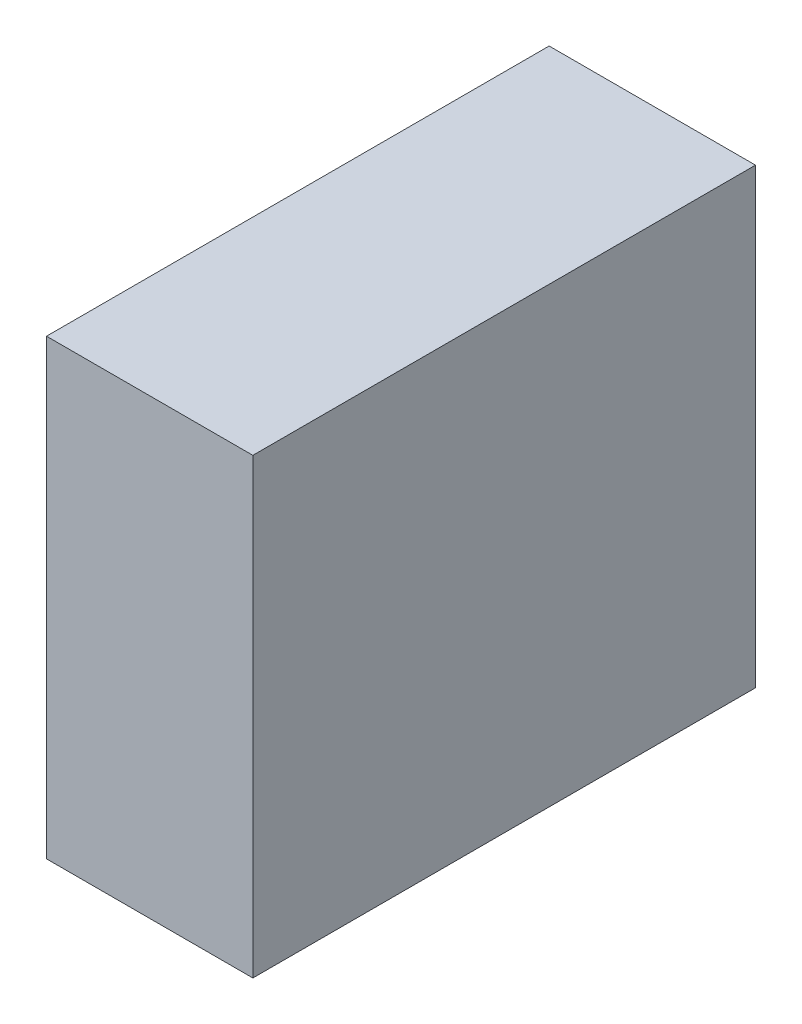
ISO-10303-21;
HEADER;
FILE_DESCRIPTION(('STEP AP214'),'2;1');
FILE_NAME('part.step','',(''),(''),'','','');
FILE_SCHEMA(('AUTOMOTIVE_DESIGN { 1 0 10303 214 1 1 1 1 }'));
ENDSEC;
DATA;
#1=APPLICATION_CONTEXT('core data for automotive mechanical design processes');
#2=APPLICATION_PROTOCOL_DEFINITION('international standard','automotive_design',2000,#1);
#3=PRODUCT_CONTEXT('',#1,'mechanical');
#4=PRODUCT('Part','Part','',(#3));
#5=PRODUCT_RELATED_PRODUCT_CATEGORY('part','',(#4));
#6=PRODUCT_DEFINITION_FORMATION('','',#4);
#7=PRODUCT_DEFINITION_CONTEXT('part definition',#1,'design');
#8=PRODUCT_DEFINITION('design','',#6,#7);
#9=PRODUCT_DEFINITION_SHAPE('','',#8);
#10=(LENGTH_UNIT() NAMED_UNIT(*) SI_UNIT(.MILLI.,.METRE.));
#11=(NAMED_UNIT(*) PLANE_ANGLE_UNIT() SI_UNIT($,.RADIAN.));
#12=(NAMED_UNIT(*) SI_UNIT($,.STERADIAN.) SOLID_ANGLE_UNIT());
#13=UNCERTAINTY_MEASURE_WITH_UNIT(LENGTH_MEASURE(1.E-05),#10,'distance_accuracy_value','');
#14=(GEOMETRIC_REPRESENTATION_CONTEXT(3) GLOBAL_UNCERTAINTY_ASSIGNED_CONTEXT((#13)) GLOBAL_UNIT_ASSIGNED_CONTEXT((#10,
#11,#12)) REPRESENTATION_CONTEXT('',''));
#15=CARTESIAN_POINT('',(0.,0.,0.));
#16=DIRECTION('',(0.,0.,1.));
#17=DIRECTION('',(1.,0.,0.));
#18=AXIS2_PLACEMENT_3D('',#15,#16,#17);
#19=CARTESIAN_POINT('',(38.2695703209719,1.49999995944139,23.435));
#20=DIRECTION('',(0.,-1.,0.));
#21=DIRECTION('',(0.,0.,-1.));
#22=AXIS2_PLACEMENT_3D('',#19,#20,#21);
#23=PLANE('',#22);
#24=DIRECTION('',(1.,0.,0.));
#25=VECTOR('',#24,1.);
#26=CARTESIAN_POINT('',(42.6021416337541,1.49999995944139,18.57));
#27=LINE('',#26,#25);
#28=CARTESIAN_POINT('',(34.0221416337541,1.49999995944138,18.57));
#29=VERTEX_POINT('',#28);
#30=CARTESIAN_POINT('',(42.6021416337541,1.49999995944139,18.57));
#31=VERTEX_POINT('',#30);
#32=EDGE_CURVE('E26',#29,#31,#27,.T.);
#33=ORIENTED_EDGE('',*,*,#32,.T.);
#34=DIRECTION('',(0.,0.,1.));
#35=VECTOR('',#34,1.);
#36=CARTESIAN_POINT('',(42.6021416337541,1.49999995944139,39.47));
#37=LINE('',#36,#35);
#38=CARTESIAN_POINT('',(42.6021416337541,1.49999995944139,39.47));
#39=VERTEX_POINT('',#38);
#40=EDGE_CURVE('E11',#31,#39,#37,.T.);
#41=ORIENTED_EDGE('',*,*,#40,.T.);
#42=DIRECTION('',(-1.,0.,0.));
#43=VECTOR('',#42,1.);
#44=CARTESIAN_POINT('',(21.301070816877,1.5,39.47));
#45=LINE('',#44,#43);
#46=CARTESIAN_POINT('',(34.0221416337541,1.49999995944139,39.47));
#47=VERTEX_POINT('',#46);
#48=EDGE_CURVE('E20',#39,#47,#45,.T.);
#49=ORIENTED_EDGE('',*,*,#48,.T.);
#50=DIRECTION('',(0.,0.,-1.));
#51=VECTOR('',#50,1.);
#52=CARTESIAN_POINT('',(34.0221416337541,1.5,19.735));
#53=LINE('',#52,#51);
#54=EDGE_CURVE('E60',#47,#29,#53,.T.);
#55=ORIENTED_EDGE('',*,*,#54,.T.);
#56=EDGE_LOOP('',(#33,#41,#49,#55));
#57=FACE_BOUND('',#56,.T.);
#58=ADVANCED_FACE('F16',(#57),#23,.T.);
#59=CARTESIAN_POINT('',(42.6021416337541,20.3220000107563,18.57));
#60=DIRECTION('',(1.,0.,0.));
#61=DIRECTION('',(0.,1.,0.));
#62=AXIS2_PLACEMENT_3D('',#59,#60,#61);
#63=PLANE('',#62);
#64=DIRECTION('',(0.,0.,-1.));
#65=VECTOR('',#64,1.);
#66=CARTESIAN_POINT('',(42.6021416337541,20.3220000107563,39.47));
#67=LINE('',#66,#65);
#68=CARTESIAN_POINT('',(42.6021416337541,20.3220000107563,39.47));
#69=VERTEX_POINT('',#68);
#70=CARTESIAN_POINT('',(42.6021416337541,20.3220000107563,18.57));
#71=VERTEX_POINT('',#70);
#72=EDGE_CURVE('E100',#69,#71,#67,.T.);
#73=ORIENTED_EDGE('',*,*,#72,.F.);
#74=DIRECTION('',(0.,-1.,0.));
#75=VECTOR('',#74,1.);
#76=CARTESIAN_POINT('',(42.6021416337541,20.3220000107563,39.47));
#77=LINE('',#76,#75);
#78=EDGE_CURVE('E79',#69,#39,#77,.T.);
#79=ORIENTED_EDGE('',*,*,#78,.T.);
#80=ORIENTED_EDGE('',*,*,#40,.F.);
#81=DIRECTION('',(0.,-1.,0.));
#82=VECTOR('',#81,1.);
#83=CARTESIAN_POINT('',(42.6021416337541,20.3220000107563,18.57));
#84=LINE('',#83,#82);
#85=EDGE_CURVE('E110',#71,#31,#84,.T.);
#86=ORIENTED_EDGE('',*,*,#85,.F.);
#87=EDGE_LOOP('',(#73,#79,#80,#86));
#88=FACE_BOUND('',#87,.T.);
#89=ADVANCED_FACE('F130',(#88),#63,.T.);
#90=CARTESIAN_POINT('',(34.0221416337541,20.3220000107563,18.57));
#91=DIRECTION('',(0.,0.,-1.));
#92=DIRECTION('',(0.,-1.,0.));
#93=AXIS2_PLACEMENT_3D('',#90,#91,#92);
#94=PLANE('',#93);
#95=DIRECTION('',(-1.,0.,0.));
#96=VECTOR('',#95,1.);
#97=CARTESIAN_POINT('',(42.6021416337541,20.3220000107563,18.57));
#98=LINE('',#97,#96);
#99=CARTESIAN_POINT('',(34.0221416337541,20.3220000107563,18.57));
#100=VERTEX_POINT('',#99);
#101=EDGE_CURVE('E95',#71,#100,#98,.T.);
#102=ORIENTED_EDGE('',*,*,#101,.F.);
#103=ORIENTED_EDGE('',*,*,#85,.T.);
#104=ORIENTED_EDGE('',*,*,#32,.F.);
#105=DIRECTION('',(0.,-1.,0.));
#106=VECTOR('',#105,1.);
#107=CARTESIAN_POINT('',(34.0221416337541,20.3220000107563,18.57));
#108=LINE('',#107,#106);
#109=EDGE_CURVE('E68',#100,#29,#108,.T.);
#110=ORIENTED_EDGE('',*,*,#109,.F.);
#111=EDGE_LOOP('',(#102,#103,#104,#110));
#112=FACE_BOUND('',#111,.T.);
#113=ADVANCED_FACE('F135',(#112),#94,.T.);
#114=CARTESIAN_POINT('',(34.0221416337541,20.3220000107563,39.47));
#115=DIRECTION('',(-1.,0.,0.));
#116=DIRECTION('',(0.,1.,0.));
#117=AXIS2_PLACEMENT_3D('',#114,#115,#116);
#118=PLANE('',#117);
#119=DIRECTION('',(0.,0.,1.));
#120=VECTOR('',#119,1.);
#121=CARTESIAN_POINT('',(34.0221416337541,20.3220000107563,18.57));
#122=LINE('',#121,#120);
#123=CARTESIAN_POINT('',(34.0221416337541,20.3220000107563,39.47));
#124=VERTEX_POINT('',#123);
#125=EDGE_CURVE('E86',#100,#124,#122,.T.);
#126=ORIENTED_EDGE('',*,*,#125,.F.);
#127=ORIENTED_EDGE('',*,*,#109,.T.);
#128=ORIENTED_EDGE('',*,*,#54,.F.);
#129=DIRECTION('',(0.,-1.,0.));
#130=VECTOR('',#129,1.);
#131=CARTESIAN_POINT('',(34.0221416337541,20.3220000107563,39.47));
#132=LINE('',#131,#130);
#133=EDGE_CURVE('E84',#124,#47,#132,.T.);
#134=ORIENTED_EDGE('',*,*,#133,.F.);
#135=EDGE_LOOP('',(#126,#127,#128,#134));
#136=FACE_BOUND('',#135,.T.);
#137=ADVANCED_FACE('F18',(#136),#118,.T.);
#138=CARTESIAN_POINT('',(42.6021416337541,20.3220000107563,39.47));
#139=DIRECTION('',(0.,0.,1.));
#140=DIRECTION('',(0.,-1.,0.));
#141=AXIS2_PLACEMENT_3D('',#138,#139,#140);
#142=PLANE('',#141);
#143=DIRECTION('',(1.,0.,0.));
#144=VECTOR('',#143,1.);
#145=CARTESIAN_POINT('',(34.0221416337541,20.3220000107563,39.47));
#146=LINE('',#145,#144);
#147=EDGE_CURVE('E94',#124,#69,#146,.T.);
#148=ORIENTED_EDGE('',*,*,#147,.F.);
#149=ORIENTED_EDGE('',*,*,#133,.T.);
#150=ORIENTED_EDGE('',*,*,#48,.F.);
#151=ORIENTED_EDGE('',*,*,#78,.F.);
#152=EDGE_LOOP('',(#148,#149,#150,#151));
#153=FACE_BOUND('',#152,.T.);
#154=ADVANCED_FACE('F98',(#153),#142,.T.);
#155=CARTESIAN_POINT('',(38.2695703209719,20.3220000107563,23.435));
#156=DIRECTION('',(0.,1.,0.));
#157=DIRECTION('',(1.,0.,0.));
#158=AXIS2_PLACEMENT_3D('',#155,#156,#157);
#159=PLANE('',#158);
#160=ORIENTED_EDGE('',*,*,#147,.T.);
#161=ORIENTED_EDGE('',*,*,#72,.T.);
#162=ORIENTED_EDGE('',*,*,#101,.T.);
#163=ORIENTED_EDGE('',*,*,#125,.T.);
#164=EDGE_LOOP('',(#160,#161,#162,#163));
#165=FACE_BOUND('',#164,.T.);
#166=ADVANCED_FACE('F92',(#165),#159,.T.);
#167=CLOSED_SHELL('',(#58,#89,#113,#137,#154,#166));
#168=MANIFOLD_SOLID_BREP('B1',#167);
#169=ADVANCED_BREP_SHAPE_REPRESENTATION('',(#18,#168),#14);
#170=SHAPE_DEFINITION_REPRESENTATION(#9,#169);
ENDSEC;
END-ISO-10303-21;
